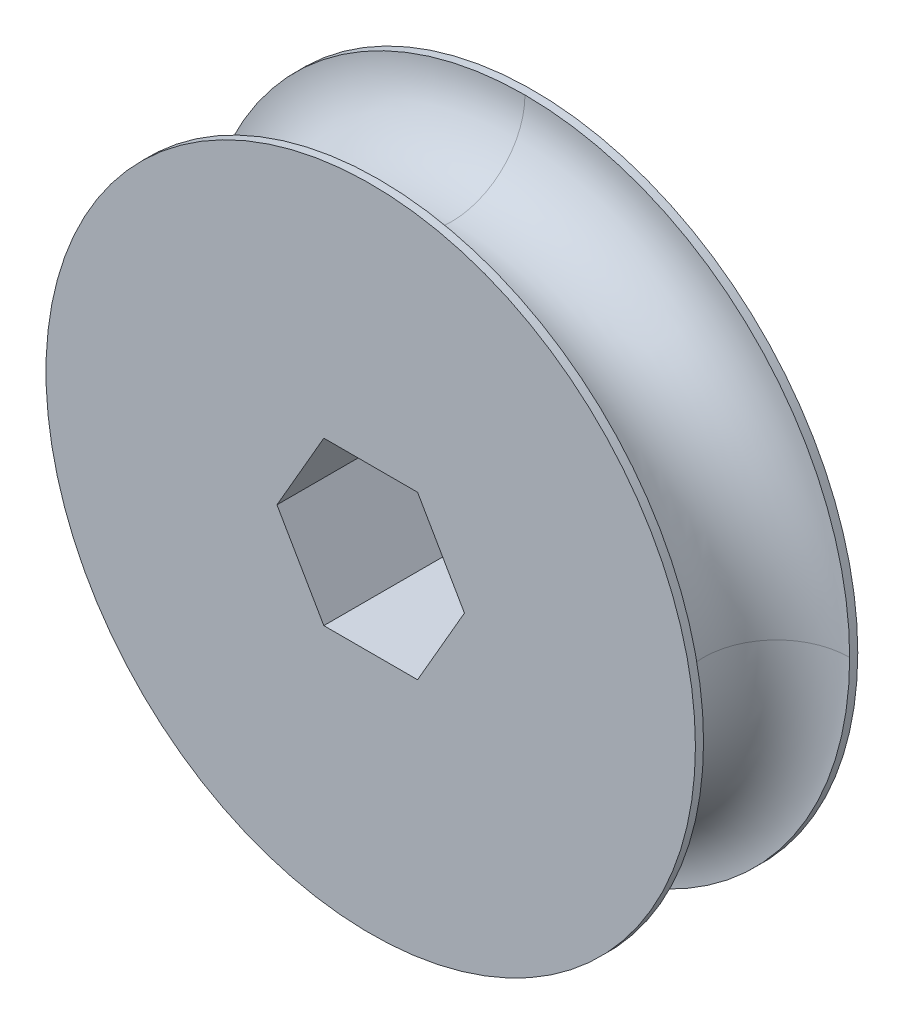
ISO-10303-21;
HEADER;
FILE_DESCRIPTION(('STEP AP214'),'2;1');
FILE_NAME('part.step','',(''),(''),'','','');
FILE_SCHEMA(('AUTOMOTIVE_DESIGN { 1 0 10303 214 1 1 1 1 }'));
ENDSEC;
DATA;
#1=APPLICATION_CONTEXT('core data for automotive mechanical design processes');
#2=APPLICATION_PROTOCOL_DEFINITION('international standard','automotive_design',2000,#1);
#3=PRODUCT_CONTEXT('',#1,'mechanical');
#4=PRODUCT('Part','Part','',(#3));
#5=PRODUCT_RELATED_PRODUCT_CATEGORY('part','',(#4));
#6=PRODUCT_DEFINITION_FORMATION('','',#4);
#7=PRODUCT_DEFINITION_CONTEXT('part definition',#1,'design');
#8=PRODUCT_DEFINITION('design','',#6,#7);
#9=PRODUCT_DEFINITION_SHAPE('','',#8);
#10=(LENGTH_UNIT() NAMED_UNIT(*) SI_UNIT(.MILLI.,.METRE.));
#11=(NAMED_UNIT(*) PLANE_ANGLE_UNIT() SI_UNIT($,.RADIAN.));
#12=(NAMED_UNIT(*) SI_UNIT($,.STERADIAN.) SOLID_ANGLE_UNIT());
#13=UNCERTAINTY_MEASURE_WITH_UNIT(LENGTH_MEASURE(1.E-05),#10,'distance_accuracy_value','');
#14=(GEOMETRIC_REPRESENTATION_CONTEXT(3) GLOBAL_UNCERTAINTY_ASSIGNED_CONTEXT((#13)) GLOBAL_UNIT_ASSIGNED_CONTEXT((#10,
#11,#12)) REPRESENTATION_CONTEXT('',''));
#15=CARTESIAN_POINT('',(0.,0.,0.));
#16=DIRECTION('',(0.,0.,1.));
#17=DIRECTION('',(1.,0.,0.));
#18=AXIS2_PLACEMENT_3D('',#15,#16,#17);
#19=CARTESIAN_POINT('',(0.,0.,0.));
#20=DIRECTION('',(0.,0.,1.));
#21=DIRECTION('',(1.,0.,0.));
#22=AXIS2_PLACEMENT_3D('',#19,#20,#21);
#23=PLANE('',#22);
#24=CARTESIAN_POINT('',(0.,0.,0.));
#25=DIRECTION('',(0.,0.,1.));
#26=DIRECTION('',(1.,0.,0.));
#27=AXIS2_PLACEMENT_3D('',#24,#25,#26);
#28=CIRCLE('',#27,25.4);
#29=CARTESIAN_POINT('',(25.4,0.,0.));
#30=VERTEX_POINT('',#29);
#31=EDGE_CURVE('E171',#30,#30,#28,.T.);
#32=ORIENTED_EDGE('',*,*,#31,.F.);
#33=EDGE_LOOP('',(#32));
#34=FACE_BOUND('',#33,.T.);
#35=DIRECTION('',(0.5,0.866025403784439,0.));
#36=VECTOR('',#35,1.);
#37=CARTESIAN_POINT('',(3.66617420935412,-6.35,0.));
#38=LINE('',#37,#36);
#39=CARTESIAN_POINT('',(3.66617420935412,-6.35,0.));
#40=VERTEX_POINT('',#39);
#41=CARTESIAN_POINT('',(7.33234841870825,0.,0.));
#42=VERTEX_POINT('',#41);
#43=EDGE_CURVE('E55',#40,#42,#38,.T.);
#44=ORIENTED_EDGE('',*,*,#43,.T.);
#45=DIRECTION('',(-0.5,0.866025403784438,0.));
#46=VECTOR('',#45,1.);
#47=CARTESIAN_POINT('',(7.33234841870825,0.,0.));
#48=LINE('',#47,#46);
#49=CARTESIAN_POINT('',(3.66617420935412,6.35,0.));
#50=VERTEX_POINT('',#49);
#51=EDGE_CURVE('E114',#42,#50,#48,.T.);
#52=ORIENTED_EDGE('',*,*,#51,.T.);
#53=DIRECTION('',(-1.,0.,0.));
#54=VECTOR('',#53,1.);
#55=CARTESIAN_POINT('',(3.66617420935412,6.35,0.));
#56=LINE('',#55,#54);
#57=CARTESIAN_POINT('',(-3.66617420935412,6.35,0.));
#58=VERTEX_POINT('',#57);
#59=EDGE_CURVE('E121',#50,#58,#56,.T.);
#60=ORIENTED_EDGE('',*,*,#59,.T.);
#61=DIRECTION('',(-0.5,-0.866025403784439,0.));
#62=VECTOR('',#61,1.);
#63=CARTESIAN_POINT('',(-3.66617420935412,6.35,0.));
#64=LINE('',#63,#62);
#65=CARTESIAN_POINT('',(-7.33234841870825,0.,0.));
#66=VERTEX_POINT('',#65);
#67=EDGE_CURVE('E131',#58,#66,#64,.T.);
#68=ORIENTED_EDGE('',*,*,#67,.T.);
#69=DIRECTION('',(0.5,-0.866025403784438,0.));
#70=VECTOR('',#69,1.);
#71=CARTESIAN_POINT('',(-7.33234841870825,0.,0.));
#72=LINE('',#71,#70);
#73=CARTESIAN_POINT('',(-3.66617420935412,-6.35,0.));
#74=VERTEX_POINT('',#73);
#75=EDGE_CURVE('E135',#66,#74,#72,.T.);
#76=ORIENTED_EDGE('',*,*,#75,.T.);
#77=DIRECTION('',(1.,0.,0.));
#78=VECTOR('',#77,1.);
#79=CARTESIAN_POINT('',(-3.66617420935412,-6.35,0.));
#80=LINE('',#79,#78);
#81=EDGE_CURVE('E125',#74,#40,#80,.T.);
#82=ORIENTED_EDGE('',*,*,#81,.T.);
#83=EDGE_LOOP('',(#44,#52,#60,#68,#76,#82));
#84=FACE_BOUND('',#83,.T.);
#85=ADVANCED_FACE('F39',(#34,#84),#23,.F.);
#86=CARTESIAN_POINT('',(0.,0.,12.7));
#87=DIRECTION('',(0.,0.,1.));
#88=DIRECTION('',(1.,0.,0.));
#89=AXIS2_PLACEMENT_3D('',#86,#87,#88);
#90=PLANE('',#89);
#91=CARTESIAN_POINT('',(0.,0.,12.7));
#92=DIRECTION('',(0.,0.,1.));
#93=DIRECTION('',(1.,0.,0.));
#94=AXIS2_PLACEMENT_3D('',#91,#92,#93);
#95=CIRCLE('',#94,25.4);
#96=CARTESIAN_POINT('',(25.4,0.,12.7));
#97=VERTEX_POINT('',#96);
#98=EDGE_CURVE('E174',#97,#97,#95,.T.);
#99=ORIENTED_EDGE('',*,*,#98,.T.);
#100=EDGE_LOOP('',(#99));
#101=FACE_BOUND('',#100,.T.);
#102=DIRECTION('',(0.5,-0.866025403784439,0.));
#103=VECTOR('',#102,1.);
#104=CARTESIAN_POINT('',(5.49926131403118,3.175,12.7));
#105=LINE('',#104,#103);
#106=CARTESIAN_POINT('',(3.66617420935412,6.35,12.7));
#107=VERTEX_POINT('',#106);
#108=CARTESIAN_POINT('',(7.33234841870825,0.,12.7));
#109=VERTEX_POINT('',#108);
#110=EDGE_CURVE('E48',#107,#109,#105,.T.);
#111=ORIENTED_EDGE('',*,*,#110,.T.);
#112=DIRECTION('',(-0.5,-0.866025403784439,0.));
#113=VECTOR('',#112,1.);
#114=CARTESIAN_POINT('',(5.49926131403118,-3.175,12.7));
#115=LINE('',#114,#113);
#116=CARTESIAN_POINT('',(3.66617420935412,-6.35,12.7));
#117=VERTEX_POINT('',#116);
#118=EDGE_CURVE('E11',#109,#117,#115,.T.);
#119=ORIENTED_EDGE('',*,*,#118,.T.);
#120=DIRECTION('',(-1.,0.,0.));
#121=VECTOR('',#120,1.);
#122=CARTESIAN_POINT('',(0.,-6.35,12.7));
#123=LINE('',#122,#121);
#124=CARTESIAN_POINT('',(-3.66617420935412,-6.35,12.7));
#125=VERTEX_POINT('',#124);
#126=EDGE_CURVE('E178',#117,#125,#123,.T.);
#127=ORIENTED_EDGE('',*,*,#126,.T.);
#128=DIRECTION('',(-0.5,0.866025403784439,0.));
#129=VECTOR('',#128,1.);
#130=CARTESIAN_POINT('',(-5.49926131403118,-3.175,12.7));
#131=LINE('',#130,#129);
#132=CARTESIAN_POINT('',(-7.33234841870825,0.,12.7));
#133=VERTEX_POINT('',#132);
#134=EDGE_CURVE('E185',#125,#133,#131,.T.);
#135=ORIENTED_EDGE('',*,*,#134,.T.);
#136=DIRECTION('',(0.5,0.866025403784439,0.));
#137=VECTOR('',#136,1.);
#138=CARTESIAN_POINT('',(-5.49926131403118,3.175,12.7));
#139=LINE('',#138,#137);
#140=CARTESIAN_POINT('',(-3.66617420935412,6.35,12.7));
#141=VERTEX_POINT('',#140);
#142=EDGE_CURVE('E189',#133,#141,#139,.T.);
#143=ORIENTED_EDGE('',*,*,#142,.T.);
#144=DIRECTION('',(1.,0.,0.));
#145=VECTOR('',#144,1.);
#146=CARTESIAN_POINT('',(0.,6.35,12.7));
#147=LINE('',#146,#145);
#148=EDGE_CURVE('E193',#141,#107,#147,.T.);
#149=ORIENTED_EDGE('',*,*,#148,.T.);
#150=EDGE_LOOP('',(#111,#119,#127,#135,#143,#149));
#151=FACE_BOUND('',#150,.T.);
#152=ADVANCED_FACE('F198',(#101,#151),#90,.T.);
#153=CARTESIAN_POINT('',(0.,0.,12.7));
#154=DIRECTION('',(0.,0.,-1.));
#155=DIRECTION('',(-1.,0.,0.));
#156=AXIS2_PLACEMENT_3D('',#153,#154,#155);
#157=CYLINDRICAL_SURFACE('',#156,25.4);
#158=CARTESIAN_POINT('',(0.,0.,0.635));
#159=DIRECTION('',(0.,0.,-1.));
#160=DIRECTION('',(1.,0.,0.));
#161=AXIS2_PLACEMENT_3D('',#158,#159,#160);
#162=CIRCLE('',#161,25.4);
#163=CARTESIAN_POINT('',(25.4,0.,0.635));
#164=VERTEX_POINT('',#163);
#165=CARTESIAN_POINT('',(0.,25.4,0.635));
#166=VERTEX_POINT('',#165);
#167=EDGE_CURVE('E167',#164,#166,#162,.T.);
#168=ORIENTED_EDGE('',*,*,#167,.T.);
#169=CARTESIAN_POINT('',(0.,0.,0.635));
#170=DIRECTION('',(0.,0.,-1.));
#171=DIRECTION('',(0.,1.,0.));
#172=AXIS2_PLACEMENT_3D('',#169,#170,#171);
#173=CIRCLE('',#172,25.4);
#174=EDGE_CURVE('E160',#166,#164,#173,.T.);
#175=ORIENTED_EDGE('',*,*,#174,.T.);
#176=EDGE_LOOP('',(#168,#175));
#177=FACE_BOUND('',#176,.T.);
#178=ORIENTED_EDGE('',*,*,#31,.T.);
#179=EDGE_LOOP('',(#178));
#180=FACE_BOUND('',#179,.T.);
#181=ADVANCED_FACE('F221',(#177,#180),#157,.T.);
#182=CARTESIAN_POINT('',(0.,0.,6.35));
#183=DIRECTION('',(0.,0.,-1.));
#184=DIRECTION('',(-1.,0.,0.));
#185=AXIS2_PLACEMENT_3D('',#182,#183,#184);
#186=TOROIDAL_SURFACE('',#185,25.4,5.715);
#187=ORIENTED_EDGE('',*,*,#174,.F.);
#188=CARTESIAN_POINT('',(0.,25.4,6.35));
#189=DIRECTION('',(1.,0.,0.));
#190=DIRECTION('',(0.,0.,1.));
#191=AXIS2_PLACEMENT_3D('',#188,#189,#190);
#192=CIRCLE('',#191,5.715);
#193=CARTESIAN_POINT('',(0.,25.4,12.065));
#194=VERTEX_POINT('',#193);
#195=EDGE_CURVE('E110',#194,#166,#192,.T.);
#196=ORIENTED_EDGE('',*,*,#195,.F.);
#197=CARTESIAN_POINT('',(0.,0.,12.065));
#198=DIRECTION('',(0.,0.,-1.));
#199=DIRECTION('',(0.,1.,0.));
#200=AXIS2_PLACEMENT_3D('',#197,#198,#199);
#201=CIRCLE('',#200,25.4);
#202=CARTESIAN_POINT('',(25.4,0.,12.065));
#203=VERTEX_POINT('',#202);
#204=EDGE_CURVE('E155',#194,#203,#201,.T.);
#205=ORIENTED_EDGE('',*,*,#204,.T.);
#206=CARTESIAN_POINT('',(25.4,0.,6.35));
#207=DIRECTION('',(0.,-1.,0.));
#208=DIRECTION('',(0.,0.,1.));
#209=AXIS2_PLACEMENT_3D('',#206,#207,#208);
#210=CIRCLE('',#209,5.715);
#211=EDGE_CURVE('E156',#203,#164,#210,.T.);
#212=ORIENTED_EDGE('',*,*,#211,.T.);
#213=EDGE_LOOP('',(#187,#196,#205,#212));
#214=FACE_BOUND('',#213,.T.);
#215=ADVANCED_FACE('F229',(#214),#186,.F.);
#216=CARTESIAN_POINT('',(0.,0.,6.35));
#217=DIRECTION('',(0.,0.,-1.));
#218=DIRECTION('',(-1.,0.,0.));
#219=AXIS2_PLACEMENT_3D('',#216,#217,#218);
#220=TOROIDAL_SURFACE('',#219,25.4,5.715);
#221=ORIENTED_EDGE('',*,*,#195,.T.);
#222=ORIENTED_EDGE('',*,*,#167,.F.);
#223=ORIENTED_EDGE('',*,*,#211,.F.);
#224=CARTESIAN_POINT('',(0.,0.,12.065));
#225=DIRECTION('',(0.,0.,-1.));
#226=DIRECTION('',(1.,0.,0.));
#227=AXIS2_PLACEMENT_3D('',#224,#225,#226);
#228=CIRCLE('',#227,25.4);
#229=EDGE_CURVE('E164',#203,#194,#228,.T.);
#230=ORIENTED_EDGE('',*,*,#229,.T.);
#231=EDGE_LOOP('',(#221,#222,#223,#230));
#232=FACE_BOUND('',#231,.T.);
#233=ADVANCED_FACE('F226',(#232),#220,.F.);
#234=ORIENTED_EDGE('',*,*,#229,.F.);
#235=ORIENTED_EDGE('',*,*,#204,.F.);
#236=EDGE_LOOP('',(#234,#235));
#237=FACE_BOUND('',#236,.T.);
#238=ORIENTED_EDGE('',*,*,#98,.F.);
#239=EDGE_LOOP('',(#238));
#240=FACE_BOUND('',#239,.T.);
#241=ADVANCED_FACE('F41',(#237,#240),#157,.T.);
#242=CARTESIAN_POINT('',(3.66617420935412,-6.35,17.272));
#243=DIRECTION('',(-0.866025403784439,0.5,0.));
#244=DIRECTION('',(-0.5,-0.866025403784439,0.));
#245=AXIS2_PLACEMENT_3D('',#242,#243,#244);
#246=PLANE('',#245);
#247=DIRECTION('',(0.,0.,-1.));
#248=VECTOR('',#247,1.);
#249=CARTESIAN_POINT('',(7.33234841870825,0.,17.272));
#250=LINE('',#249,#248);
#251=EDGE_CURVE('E104',#109,#42,#250,.T.);
#252=ORIENTED_EDGE('',*,*,#251,.T.);
#253=ORIENTED_EDGE('',*,*,#43,.F.);
#254=DIRECTION('',(0.,0.,-1.));
#255=VECTOR('',#254,1.);
#256=CARTESIAN_POINT('',(3.66617420935412,-6.35,17.272));
#257=LINE('',#256,#255);
#258=EDGE_CURVE('E140',#117,#40,#257,.T.);
#259=ORIENTED_EDGE('',*,*,#258,.F.);
#260=ORIENTED_EDGE('',*,*,#118,.F.);
#261=EDGE_LOOP('',(#252,#253,#259,#260));
#262=FACE_BOUND('',#261,.T.);
#263=ADVANCED_FACE('F106',(#262),#246,.T.);
#264=CARTESIAN_POINT('',(7.33234841870825,0.,17.272));
#265=DIRECTION('',(-0.866025403784438,-0.5,0.));
#266=DIRECTION('',(0.5,-0.866025403784439,0.));
#267=AXIS2_PLACEMENT_3D('',#264,#265,#266);
#268=PLANE('',#267);
#269=DIRECTION('',(0.,0.,-1.));
#270=VECTOR('',#269,1.);
#271=CARTESIAN_POINT('',(3.66617420935412,6.35,17.272));
#272=LINE('',#271,#270);
#273=EDGE_CURVE('E111',#107,#50,#272,.T.);
#274=ORIENTED_EDGE('',*,*,#273,.T.);
#275=ORIENTED_EDGE('',*,*,#51,.F.);
#276=ORIENTED_EDGE('',*,*,#251,.F.);
#277=ORIENTED_EDGE('',*,*,#110,.F.);
#278=EDGE_LOOP('',(#274,#275,#276,#277));
#279=FACE_BOUND('',#278,.T.);
#280=ADVANCED_FACE('F115',(#279),#268,.T.);
#281=CARTESIAN_POINT('',(3.66617420935412,6.35,17.272));
#282=DIRECTION('',(0.,-1.,0.));
#283=DIRECTION('',(0.,0.,-1.));
#284=AXIS2_PLACEMENT_3D('',#281,#282,#283);
#285=PLANE('',#284);
#286=DIRECTION('',(0.,0.,-1.));
#287=VECTOR('',#286,1.);
#288=CARTESIAN_POINT('',(-3.66617420935412,6.35,17.272));
#289=LINE('',#288,#287);
#290=EDGE_CURVE('E148',#141,#58,#289,.T.);
#291=ORIENTED_EDGE('',*,*,#290,.T.);
#292=ORIENTED_EDGE('',*,*,#59,.F.);
#293=ORIENTED_EDGE('',*,*,#273,.F.);
#294=ORIENTED_EDGE('',*,*,#148,.F.);
#295=EDGE_LOOP('',(#291,#292,#293,#294));
#296=FACE_BOUND('',#295,.T.);
#297=ADVANCED_FACE('F200',(#296),#285,.T.);
#298=CARTESIAN_POINT('',(-3.66617420935412,6.35,17.272));
#299=DIRECTION('',(0.866025403784439,-0.5,0.));
#300=DIRECTION('',(0.5,0.866025403784439,0.));
#301=AXIS2_PLACEMENT_3D('',#298,#299,#300);
#302=PLANE('',#301);
#303=DIRECTION('',(0.,0.,-1.));
#304=VECTOR('',#303,1.);
#305=CARTESIAN_POINT('',(-7.33234841870825,0.,17.272));
#306=LINE('',#305,#304);
#307=EDGE_CURVE('E145',#133,#66,#306,.T.);
#308=ORIENTED_EDGE('',*,*,#307,.T.);
#309=ORIENTED_EDGE('',*,*,#67,.F.);
#310=ORIENTED_EDGE('',*,*,#290,.F.);
#311=ORIENTED_EDGE('',*,*,#142,.F.);
#312=EDGE_LOOP('',(#308,#309,#310,#311));
#313=FACE_BOUND('',#312,.T.);
#314=ADVANCED_FACE('F205',(#313),#302,.T.);
#315=CARTESIAN_POINT('',(-7.33234841870825,0.,17.272));
#316=DIRECTION('',(0.866025403784438,0.5,0.));
#317=DIRECTION('',(-0.5,0.866025403784439,0.));
#318=AXIS2_PLACEMENT_3D('',#315,#316,#317);
#319=PLANE('',#318);
#320=DIRECTION('',(0.,0.,-1.));
#321=VECTOR('',#320,1.);
#322=CARTESIAN_POINT('',(-3.66617420935412,-6.35,17.272));
#323=LINE('',#322,#321);
#324=EDGE_CURVE('E63',#125,#74,#323,.T.);
#325=ORIENTED_EDGE('',*,*,#324,.T.);
#326=ORIENTED_EDGE('',*,*,#75,.F.);
#327=ORIENTED_EDGE('',*,*,#307,.F.);
#328=ORIENTED_EDGE('',*,*,#134,.F.);
#329=EDGE_LOOP('',(#325,#326,#327,#328));
#330=FACE_BOUND('',#329,.T.);
#331=ADVANCED_FACE('F208',(#330),#319,.T.);
#332=CARTESIAN_POINT('',(-3.66617420935412,-6.35,17.272));
#333=DIRECTION('',(0.,1.,0.));
#334=DIRECTION('',(-1.,0.,0.));
#335=AXIS2_PLACEMENT_3D('',#332,#333,#334);
#336=PLANE('',#335);
#337=ORIENTED_EDGE('',*,*,#258,.T.);
#338=ORIENTED_EDGE('',*,*,#81,.F.);
#339=ORIENTED_EDGE('',*,*,#324,.F.);
#340=ORIENTED_EDGE('',*,*,#126,.F.);
#341=EDGE_LOOP('',(#337,#338,#339,#340));
#342=FACE_BOUND('',#341,.T.);
#343=ADVANCED_FACE('F209',(#342),#336,.T.);
#344=CLOSED_SHELL('',(#85,#152,#181,#215,#233,#241,#263,#280,#297,#314,#331,#343));
#345=MANIFOLD_SOLID_BREP('B2',#344);
#346=ADVANCED_BREP_SHAPE_REPRESENTATION('',(#18,#345),#14);
#347=SHAPE_DEFINITION_REPRESENTATION(#9,#346);
ENDSEC;
END-ISO-10303-21;
